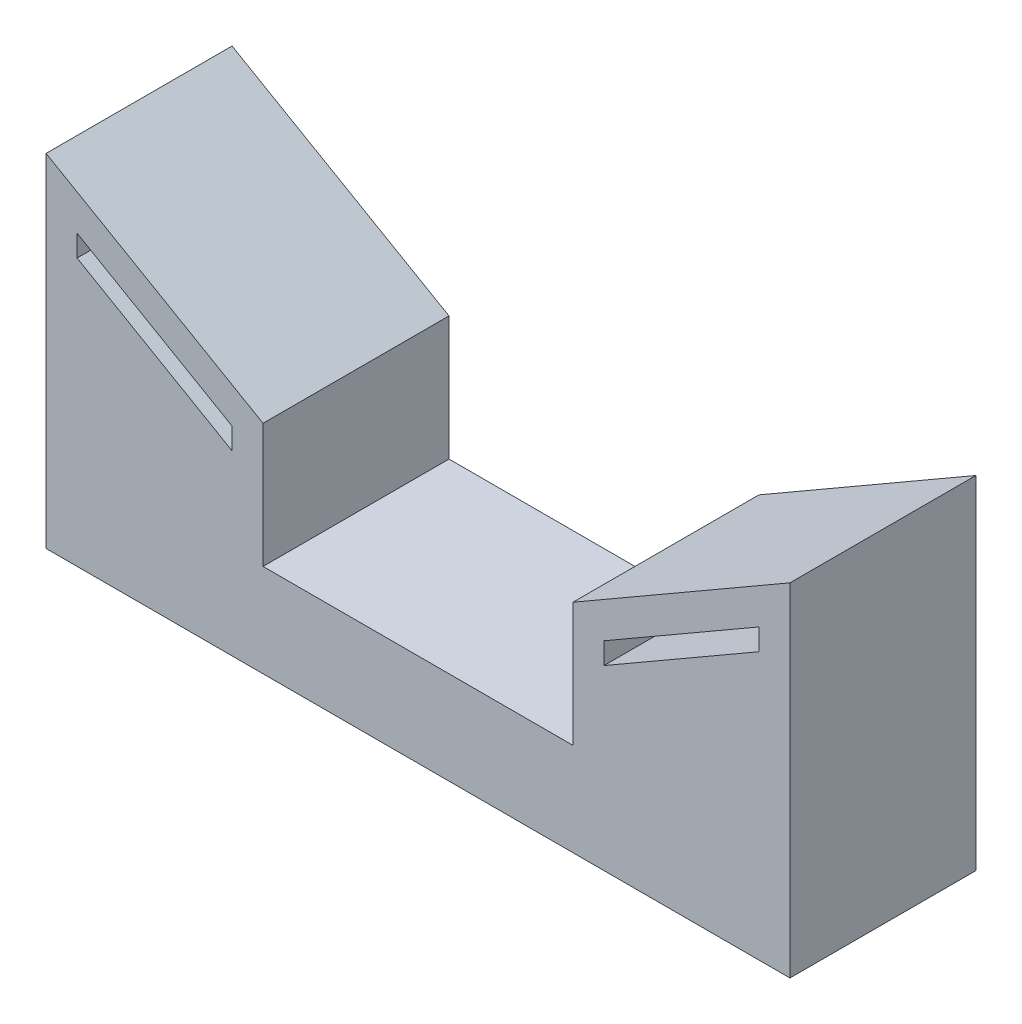
ISO-10303-21;
HEADER;
FILE_DESCRIPTION(('STEP AP214'),'2;1');
FILE_NAME('part.step','',(''),(''),'','','');
FILE_SCHEMA(('AUTOMOTIVE_DESIGN { 1 0 10303 214 1 1 1 1 }'));
ENDSEC;
DATA;
#1=APPLICATION_CONTEXT('core data for automotive mechanical design processes');
#2=APPLICATION_PROTOCOL_DEFINITION('international standard','automotive_design',2000,#1);
#3=PRODUCT_CONTEXT('',#1,'mechanical');
#4=PRODUCT('Part','Part','',(#3));
#5=PRODUCT_RELATED_PRODUCT_CATEGORY('part','',(#4));
#6=PRODUCT_DEFINITION_FORMATION('','',#4);
#7=PRODUCT_DEFINITION_CONTEXT('part definition',#1,'design');
#8=PRODUCT_DEFINITION('design','',#6,#7);
#9=PRODUCT_DEFINITION_SHAPE('','',#8);
#10=(LENGTH_UNIT() NAMED_UNIT(*) SI_UNIT(.MILLI.,.METRE.));
#11=(NAMED_UNIT(*) PLANE_ANGLE_UNIT() SI_UNIT($,.RADIAN.));
#12=(NAMED_UNIT(*) SI_UNIT($,.STERADIAN.) SOLID_ANGLE_UNIT());
#13=UNCERTAINTY_MEASURE_WITH_UNIT(LENGTH_MEASURE(1.E-05),#10,'distance_accuracy_value','');
#14=(GEOMETRIC_REPRESENTATION_CONTEXT(3) GLOBAL_UNCERTAINTY_ASSIGNED_CONTEXT((#13)) GLOBAL_UNIT_ASSIGNED_CONTEXT((#10,
#11,#12)) REPRESENTATION_CONTEXT('',''));
#15=CARTESIAN_POINT('',(0.,0.,0.));
#16=DIRECTION('',(0.,0.,1.));
#17=DIRECTION('',(1.,0.,0.));
#18=AXIS2_PLACEMENT_3D('',#15,#16,#17);
#19=CARTESIAN_POINT('',(0.,0.,30.));
#20=DIRECTION('',(0.,0.,-1.));
#21=DIRECTION('',(-1.,0.,0.));
#22=AXIS2_PLACEMENT_3D('',#19,#20,#21);
#23=PLANE('',#22);
#24=DIRECTION('',(0.,1.,0.));
#25=VECTOR('',#24,1.);
#26=CARTESIAN_POINT('',(55.,31.5470053837924,30.));
#27=LINE('',#26,#25);
#28=CARTESIAN_POINT('',(55.,28.0829037686547,30.));
#29=VERTEX_POINT('',#28);
#30=CARTESIAN_POINT('',(55.,31.5470053837924,30.));
#31=VERTEX_POINT('',#30);
#32=EDGE_CURVE('E184',#29,#31,#27,.T.);
#33=ORIENTED_EDGE('',*,*,#32,.F.);
#34=DIRECTION('',(0.86602540378444,0.499999999999998,0.));
#35=VECTOR('',#34,1.);
#36=CARTESIAN_POINT('',(30.,13.6491470389141,30.));
#37=LINE('',#36,#35);
#38=CARTESIAN_POINT('',(30.,13.6491470389141,30.));
#39=VERTEX_POINT('',#38);
#40=EDGE_CURVE('E192',#39,#29,#37,.T.);
#41=ORIENTED_EDGE('',*,*,#40,.F.);
#42=DIRECTION('',(0.,-1.,0.));
#43=VECTOR('',#42,1.);
#44=CARTESIAN_POINT('',(30.,17.1132486540519,30.));
#45=LINE('',#44,#43);
#46=CARTESIAN_POINT('',(30.,17.1132486540519,30.));
#47=VERTEX_POINT('',#46);
#48=EDGE_CURVE('E189',#47,#39,#45,.T.);
#49=ORIENTED_EDGE('',*,*,#48,.F.);
#50=DIRECTION('',(-0.86602540378444,-0.499999999999998,0.));
#51=VECTOR('',#50,1.);
#52=CARTESIAN_POINT('',(30.,17.1132486540519,30.));
#53=LINE('',#52,#51);
#54=EDGE_CURVE('E186',#31,#47,#53,.T.);
#55=ORIENTED_EDGE('',*,*,#54,.F.);
#56=EDGE_LOOP('',(#33,#41,#49,#55));
#57=FACE_BOUND('',#56,.T.);
#58=DIRECTION('',(0.,-1.,0.));
#59=VECTOR('',#58,1.);
#60=CARTESIAN_POINT('',(-60.,0.,30.));
#61=LINE('',#60,#59);
#62=CARTESIAN_POINT('',(-60.,40.2072594216368,30.));
#63=VERTEX_POINT('',#62);
#64=CARTESIAN_POINT('',(-60.,-15.,30.));
#65=VERTEX_POINT('',#64);
#66=EDGE_CURVE('E215',#63,#65,#61,.T.);
#67=ORIENTED_EDGE('',*,*,#66,.T.);
#68=DIRECTION('',(1.,0.,0.));
#69=VECTOR('',#68,1.);
#70=CARTESIAN_POINT('',(60.,-15.,30.));
#71=LINE('',#70,#69);
#72=CARTESIAN_POINT('',(60.,-15.,30.));
#73=VERTEX_POINT('',#72);
#74=EDGE_CURVE('E218',#65,#73,#71,.T.);
#75=ORIENTED_EDGE('',*,*,#74,.T.);
#76=DIRECTION('',(0.,1.,0.));
#77=VECTOR('',#76,1.);
#78=CARTESIAN_POINT('',(60.,0.,30.));
#79=LINE('',#78,#77);
#80=CARTESIAN_POINT('',(60.,40.2072594216368,30.));
#81=VERTEX_POINT('',#80);
#82=EDGE_CURVE('E221',#73,#81,#79,.T.);
#83=ORIENTED_EDGE('',*,*,#82,.T.);
#84=DIRECTION('',(-0.866025403784439,-0.499999999999998,0.));
#85=VECTOR('',#84,1.);
#86=CARTESIAN_POINT('',(25.,20.,30.));
#87=LINE('',#86,#85);
#88=CARTESIAN_POINT('',(25.,20.,30.));
#89=VERTEX_POINT('',#88);
#90=EDGE_CURVE('E223',#81,#89,#87,.T.);
#91=ORIENTED_EDGE('',*,*,#90,.T.);
#92=DIRECTION('',(0.,-1.,0.));
#93=VECTOR('',#92,1.);
#94=CARTESIAN_POINT('',(25.,20.,30.));
#95=LINE('',#94,#93);
#96=CARTESIAN_POINT('',(25.,0.,30.));
#97=VERTEX_POINT('',#96);
#98=EDGE_CURVE('E225',#89,#97,#95,.T.);
#99=ORIENTED_EDGE('',*,*,#98,.T.);
#100=DIRECTION('',(-1.,0.,0.));
#101=VECTOR('',#100,1.);
#102=CARTESIAN_POINT('',(25.,0.,30.));
#103=LINE('',#102,#101);
#104=CARTESIAN_POINT('',(-25.,0.,30.));
#105=VERTEX_POINT('',#104);
#106=EDGE_CURVE('E227',#97,#105,#103,.T.);
#107=ORIENTED_EDGE('',*,*,#106,.T.);
#108=DIRECTION('',(0.,1.,0.));
#109=VECTOR('',#108,1.);
#110=CARTESIAN_POINT('',(-25.,20.,30.));
#111=LINE('',#110,#109);
#112=CARTESIAN_POINT('',(-25.,20.,30.));
#113=VERTEX_POINT('',#112);
#114=EDGE_CURVE('E229',#105,#113,#111,.T.);
#115=ORIENTED_EDGE('',*,*,#114,.T.);
#116=DIRECTION('',(-0.866025403784439,0.499999999999998,0.));
#117=VECTOR('',#116,1.);
#118=CARTESIAN_POINT('',(-25.,20.,30.));
#119=LINE('',#118,#117);
#120=EDGE_CURVE('E231',#113,#63,#119,.T.);
#121=ORIENTED_EDGE('',*,*,#120,.T.);
#122=EDGE_LOOP('',(#67,#75,#83,#91,#99,#107,#115,#121));
#123=FACE_BOUND('',#122,.T.);
#124=DIRECTION('',(-0.86602540378444,0.499999999999998,0.));
#125=VECTOR('',#124,1.);
#126=CARTESIAN_POINT('',(-30.,17.1132486540519,30.));
#127=LINE('',#126,#125);
#128=CARTESIAN_POINT('',(-30.,17.1132486540519,30.));
#129=VERTEX_POINT('',#128);
#130=CARTESIAN_POINT('',(-55.,31.5470053837924,30.));
#131=VERTEX_POINT('',#130);
#132=EDGE_CURVE('E148',#129,#131,#127,.T.);
#133=ORIENTED_EDGE('',*,*,#132,.F.);
#134=DIRECTION('',(0.,1.,0.));
#135=VECTOR('',#134,1.);
#136=CARTESIAN_POINT('',(-30.,17.1132486540519,30.));
#137=LINE('',#136,#135);
#138=CARTESIAN_POINT('',(-30.,13.6491470389141,30.));
#139=VERTEX_POINT('',#138);
#140=EDGE_CURVE('E170',#139,#129,#137,.T.);
#141=ORIENTED_EDGE('',*,*,#140,.F.);
#142=DIRECTION('',(0.86602540378444,-0.499999999999998,0.));
#143=VECTOR('',#142,1.);
#144=CARTESIAN_POINT('',(-30.,13.6491470389141,30.));
#145=LINE('',#144,#143);
#146=CARTESIAN_POINT('',(-55.,28.0829037686547,30.));
#147=VERTEX_POINT('',#146);
#148=EDGE_CURVE('E168',#147,#139,#145,.T.);
#149=ORIENTED_EDGE('',*,*,#148,.F.);
#150=DIRECTION('',(0.,-1.,0.));
#151=VECTOR('',#150,1.);
#152=CARTESIAN_POINT('',(-55.,31.5470053837924,30.));
#153=LINE('',#152,#151);
#154=EDGE_CURVE('E156',#131,#147,#153,.T.);
#155=ORIENTED_EDGE('',*,*,#154,.F.);
#156=EDGE_LOOP('',(#133,#141,#149,#155));
#157=FACE_BOUND('',#156,.T.);
#158=ADVANCED_FACE('F35',(#57,#123,#157),#23,.F.);
#159=CARTESIAN_POINT('',(0.,0.,0.));
#160=DIRECTION('',(0.,0.,-1.));
#161=DIRECTION('',(-1.,0.,0.));
#162=AXIS2_PLACEMENT_3D('',#159,#160,#161);
#163=PLANE('',#162);
#164=DIRECTION('',(1.,0.,0.));
#165=VECTOR('',#164,1.);
#166=CARTESIAN_POINT('',(60.,-15.,0.));
#167=LINE('',#166,#165);
#168=CARTESIAN_POINT('',(-60.,-15.,0.));
#169=VERTEX_POINT('',#168);
#170=CARTESIAN_POINT('',(60.,-15.,0.));
#171=VERTEX_POINT('',#170);
#172=EDGE_CURVE('E214',#169,#171,#167,.T.);
#173=ORIENTED_EDGE('',*,*,#172,.F.);
#174=DIRECTION('',(0.,-1.,0.));
#175=VECTOR('',#174,1.);
#176=CARTESIAN_POINT('',(-60.,0.,0.));
#177=LINE('',#176,#175);
#178=CARTESIAN_POINT('',(-60.,40.2072594216368,0.));
#179=VERTEX_POINT('',#178);
#180=EDGE_CURVE('E219',#179,#169,#177,.T.);
#181=ORIENTED_EDGE('',*,*,#180,.F.);
#182=DIRECTION('',(-0.866025403784439,0.499999999999998,0.));
#183=VECTOR('',#182,1.);
#184=CARTESIAN_POINT('',(-25.,20.,0.));
#185=LINE('',#184,#183);
#186=CARTESIAN_POINT('',(-25.,20.,0.));
#187=VERTEX_POINT('',#186);
#188=EDGE_CURVE('E247',#187,#179,#185,.T.);
#189=ORIENTED_EDGE('',*,*,#188,.F.);
#190=DIRECTION('',(0.,1.,0.));
#191=VECTOR('',#190,1.);
#192=CARTESIAN_POINT('',(-25.,20.,0.));
#193=LINE('',#192,#191);
#194=CARTESIAN_POINT('',(-25.,0.,0.));
#195=VERTEX_POINT('',#194);
#196=EDGE_CURVE('E245',#195,#187,#193,.T.);
#197=ORIENTED_EDGE('',*,*,#196,.F.);
#198=DIRECTION('',(-1.,0.,0.));
#199=VECTOR('',#198,1.);
#200=CARTESIAN_POINT('',(25.,0.,0.));
#201=LINE('',#200,#199);
#202=CARTESIAN_POINT('',(25.,0.,0.));
#203=VERTEX_POINT('',#202);
#204=EDGE_CURVE('E243',#203,#195,#201,.T.);
#205=ORIENTED_EDGE('',*,*,#204,.F.);
#206=DIRECTION('',(0.,-1.,0.));
#207=VECTOR('',#206,1.);
#208=CARTESIAN_POINT('',(25.,20.,0.));
#209=LINE('',#208,#207);
#210=CARTESIAN_POINT('',(25.,20.,0.));
#211=VERTEX_POINT('',#210);
#212=EDGE_CURVE('E241',#211,#203,#209,.T.);
#213=ORIENTED_EDGE('',*,*,#212,.F.);
#214=DIRECTION('',(-0.866025403784439,-0.499999999999998,0.));
#215=VECTOR('',#214,1.);
#216=CARTESIAN_POINT('',(25.,20.,0.));
#217=LINE('',#216,#215);
#218=CARTESIAN_POINT('',(60.,40.2072594216368,0.));
#219=VERTEX_POINT('',#218);
#220=EDGE_CURVE('E239',#219,#211,#217,.T.);
#221=ORIENTED_EDGE('',*,*,#220,.F.);
#222=DIRECTION('',(0.,1.,0.));
#223=VECTOR('',#222,1.);
#224=CARTESIAN_POINT('',(60.,0.,0.));
#225=LINE('',#224,#223);
#226=EDGE_CURVE('E237',#171,#219,#225,.T.);
#227=ORIENTED_EDGE('',*,*,#226,.F.);
#228=EDGE_LOOP('',(#173,#181,#189,#197,#205,#213,#221,#227));
#229=FACE_BOUND('',#228,.T.);
#230=DIRECTION('',(0.86602540378444,0.499999999999998,0.));
#231=VECTOR('',#230,1.);
#232=CARTESIAN_POINT('',(30.,13.6491470389141,0.));
#233=LINE('',#232,#231);
#234=CARTESIAN_POINT('',(30.,13.6491470389141,0.));
#235=VERTEX_POINT('',#234);
#236=CARTESIAN_POINT('',(55.,28.0829037686547,0.));
#237=VERTEX_POINT('',#236);
#238=EDGE_CURVE('E187',#235,#237,#233,.T.);
#239=ORIENTED_EDGE('',*,*,#238,.T.);
#240=DIRECTION('',(0.,1.,0.));
#241=VECTOR('',#240,1.);
#242=CARTESIAN_POINT('',(55.,31.5470053837924,0.));
#243=LINE('',#242,#241);
#244=CARTESIAN_POINT('',(55.,31.5470053837924,0.));
#245=VERTEX_POINT('',#244);
#246=EDGE_CURVE('E164',#237,#245,#243,.T.);
#247=ORIENTED_EDGE('',*,*,#246,.T.);
#248=DIRECTION('',(-0.86602540378444,-0.499999999999998,0.));
#249=VECTOR('',#248,1.);
#250=CARTESIAN_POINT('',(30.,17.1132486540519,0.));
#251=LINE('',#250,#249);
#252=CARTESIAN_POINT('',(30.,17.1132486540519,0.));
#253=VERTEX_POINT('',#252);
#254=EDGE_CURVE('E197',#245,#253,#251,.T.);
#255=ORIENTED_EDGE('',*,*,#254,.T.);
#256=DIRECTION('',(0.,-1.,0.));
#257=VECTOR('',#256,1.);
#258=CARTESIAN_POINT('',(30.,17.1132486540519,0.));
#259=LINE('',#258,#257);
#260=EDGE_CURVE('E200',#253,#235,#259,.T.);
#261=ORIENTED_EDGE('',*,*,#260,.T.);
#262=EDGE_LOOP('',(#239,#247,#255,#261));
#263=FACE_BOUND('',#262,.T.);
#264=DIRECTION('',(0.,1.,0.));
#265=VECTOR('',#264,1.);
#266=CARTESIAN_POINT('',(-30.,17.1132486540519,0.));
#267=LINE('',#266,#265);
#268=CARTESIAN_POINT('',(-30.,13.6491470389141,0.));
#269=VERTEX_POINT('',#268);
#270=CARTESIAN_POINT('',(-30.,17.1132486540519,0.));
#271=VERTEX_POINT('',#270);
#272=EDGE_CURVE('E157',#269,#271,#267,.T.);
#273=ORIENTED_EDGE('',*,*,#272,.T.);
#274=DIRECTION('',(-0.86602540378444,0.499999999999998,0.));
#275=VECTOR('',#274,1.);
#276=CARTESIAN_POINT('',(-30.,17.1132486540519,0.));
#277=LINE('',#276,#275);
#278=CARTESIAN_POINT('',(-55.,31.5470053837924,0.));
#279=VERTEX_POINT('',#278);
#280=EDGE_CURVE('E58',#271,#279,#277,.T.);
#281=ORIENTED_EDGE('',*,*,#280,.T.);
#282=DIRECTION('',(0.,-1.,0.));
#283=VECTOR('',#282,1.);
#284=CARTESIAN_POINT('',(-55.,31.5470053837924,0.));
#285=LINE('',#284,#283);
#286=CARTESIAN_POINT('',(-55.,28.0829037686547,0.));
#287=VERTEX_POINT('',#286);
#288=EDGE_CURVE('E163',#279,#287,#285,.T.);
#289=ORIENTED_EDGE('',*,*,#288,.T.);
#290=DIRECTION('',(0.86602540378444,-0.499999999999998,0.));
#291=VECTOR('',#290,1.);
#292=CARTESIAN_POINT('',(-30.,13.6491470389141,0.));
#293=LINE('',#292,#291);
#294=EDGE_CURVE('E176',#287,#269,#293,.T.);
#295=ORIENTED_EDGE('',*,*,#294,.T.);
#296=EDGE_LOOP('',(#273,#281,#289,#295));
#297=FACE_BOUND('',#296,.T.);
#298=ADVANCED_FACE('F277',(#229,#263,#297),#163,.T.);
#299=CARTESIAN_POINT('',(60.,-15.,30.));
#300=DIRECTION('',(0.,1.,0.));
#301=DIRECTION('',(0.,0.,1.));
#302=AXIS2_PLACEMENT_3D('',#299,#300,#301);
#303=PLANE('',#302);
#304=ORIENTED_EDGE('',*,*,#172,.T.);
#305=DIRECTION('',(0.,0.,-1.));
#306=VECTOR('',#305,1.);
#307=CARTESIAN_POINT('',(60.,-15.,30.));
#308=LINE('',#307,#306);
#309=EDGE_CURVE('E43',#73,#171,#308,.T.);
#310=ORIENTED_EDGE('',*,*,#309,.F.);
#311=ORIENTED_EDGE('',*,*,#74,.F.);
#312=DIRECTION('',(0.,0.,-1.));
#313=VECTOR('',#312,1.);
#314=CARTESIAN_POINT('',(-60.,-15.,30.));
#315=LINE('',#314,#313);
#316=EDGE_CURVE('E11',#65,#169,#315,.T.);
#317=ORIENTED_EDGE('',*,*,#316,.T.);
#318=EDGE_LOOP('',(#304,#310,#311,#317));
#319=FACE_BOUND('',#318,.T.);
#320=ADVANCED_FACE('F37',(#319),#303,.F.);
#321=CARTESIAN_POINT('',(60.,0.,30.));
#322=DIRECTION('',(-1.,0.,0.));
#323=DIRECTION('',(0.,-1.,0.));
#324=AXIS2_PLACEMENT_3D('',#321,#322,#323);
#325=PLANE('',#324);
#326=ORIENTED_EDGE('',*,*,#226,.T.);
#327=DIRECTION('',(0.,0.,-1.));
#328=VECTOR('',#327,1.);
#329=CARTESIAN_POINT('',(60.,40.2072594216368,30.));
#330=LINE('',#329,#328);
#331=EDGE_CURVE('E264',#81,#219,#330,.T.);
#332=ORIENTED_EDGE('',*,*,#331,.F.);
#333=ORIENTED_EDGE('',*,*,#82,.F.);
#334=ORIENTED_EDGE('',*,*,#309,.T.);
#335=EDGE_LOOP('',(#326,#332,#333,#334));
#336=FACE_BOUND('',#335,.T.);
#337=ADVANCED_FACE('F270',(#336),#325,.F.);
#338=CARTESIAN_POINT('',(25.,20.,30.));
#339=DIRECTION('',(0.499999999999998,-0.866025403784439,0.));
#340=DIRECTION('',(0.86602540378444,0.499999999999999,0.));
#341=AXIS2_PLACEMENT_3D('',#338,#339,#340);
#342=PLANE('',#341);
#343=ORIENTED_EDGE('',*,*,#220,.T.);
#344=DIRECTION('',(0.,0.,-1.));
#345=VECTOR('',#344,1.);
#346=CARTESIAN_POINT('',(25.,20.,30.));
#347=LINE('',#346,#345);
#348=EDGE_CURVE('E261',#89,#211,#347,.T.);
#349=ORIENTED_EDGE('',*,*,#348,.F.);
#350=ORIENTED_EDGE('',*,*,#90,.F.);
#351=ORIENTED_EDGE('',*,*,#331,.T.);
#352=EDGE_LOOP('',(#343,#349,#350,#351));
#353=FACE_BOUND('',#352,.T.);
#354=ADVANCED_FACE('F285',(#353),#342,.F.);
#355=CARTESIAN_POINT('',(25.,20.,30.));
#356=DIRECTION('',(1.,0.,0.));
#357=DIRECTION('',(0.,1.,0.));
#358=AXIS2_PLACEMENT_3D('',#355,#356,#357);
#359=PLANE('',#358);
#360=ORIENTED_EDGE('',*,*,#212,.T.);
#361=DIRECTION('',(0.,0.,-1.));
#362=VECTOR('',#361,1.);
#363=CARTESIAN_POINT('',(25.,0.,30.));
#364=LINE('',#363,#362);
#365=EDGE_CURVE('E258',#97,#203,#364,.T.);
#366=ORIENTED_EDGE('',*,*,#365,.F.);
#367=ORIENTED_EDGE('',*,*,#98,.F.);
#368=ORIENTED_EDGE('',*,*,#348,.T.);
#369=EDGE_LOOP('',(#360,#366,#367,#368));
#370=FACE_BOUND('',#369,.T.);
#371=ADVANCED_FACE('F289',(#370),#359,.F.);
#372=CARTESIAN_POINT('',(25.,0.,30.));
#373=DIRECTION('',(0.,-1.,0.));
#374=DIRECTION('',(0.,0.,-1.));
#375=AXIS2_PLACEMENT_3D('',#372,#373,#374);
#376=PLANE('',#375);
#377=ORIENTED_EDGE('',*,*,#204,.T.);
#378=DIRECTION('',(0.,0.,-1.));
#379=VECTOR('',#378,1.);
#380=CARTESIAN_POINT('',(-25.,0.,30.));
#381=LINE('',#380,#379);
#382=EDGE_CURVE('E255',#105,#195,#381,.T.);
#383=ORIENTED_EDGE('',*,*,#382,.F.);
#384=ORIENTED_EDGE('',*,*,#106,.F.);
#385=ORIENTED_EDGE('',*,*,#365,.T.);
#386=EDGE_LOOP('',(#377,#383,#384,#385));
#387=FACE_BOUND('',#386,.T.);
#388=ADVANCED_FACE('F306',(#387),#376,.F.);
#389=CARTESIAN_POINT('',(-25.,20.,30.));
#390=DIRECTION('',(-1.,0.,0.));
#391=DIRECTION('',(0.,-1.,0.));
#392=AXIS2_PLACEMENT_3D('',#389,#390,#391);
#393=PLANE('',#392);
#394=ORIENTED_EDGE('',*,*,#196,.T.);
#395=DIRECTION('',(0.,0.,-1.));
#396=VECTOR('',#395,1.);
#397=CARTESIAN_POINT('',(-25.,20.,30.));
#398=LINE('',#397,#396);
#399=EDGE_CURVE('E252',#113,#187,#398,.T.);
#400=ORIENTED_EDGE('',*,*,#399,.F.);
#401=ORIENTED_EDGE('',*,*,#114,.F.);
#402=ORIENTED_EDGE('',*,*,#382,.T.);
#403=EDGE_LOOP('',(#394,#400,#401,#402));
#404=FACE_BOUND('',#403,.T.);
#405=ADVANCED_FACE('F303',(#404),#393,.F.);
#406=CARTESIAN_POINT('',(-25.,20.,30.));
#407=DIRECTION('',(-0.499999999999998,-0.866025403784439,0.));
#408=DIRECTION('',(0.86602540378444,-0.499999999999999,0.));
#409=AXIS2_PLACEMENT_3D('',#406,#407,#408);
#410=PLANE('',#409);
#411=ORIENTED_EDGE('',*,*,#188,.T.);
#412=DIRECTION('',(0.,0.,-1.));
#413=VECTOR('',#412,1.);
#414=CARTESIAN_POINT('',(-60.,40.2072594216368,30.));
#415=LINE('',#414,#413);
#416=EDGE_CURVE('E234',#63,#179,#415,.T.);
#417=ORIENTED_EDGE('',*,*,#416,.F.);
#418=ORIENTED_EDGE('',*,*,#120,.F.);
#419=ORIENTED_EDGE('',*,*,#399,.T.);
#420=EDGE_LOOP('',(#411,#417,#418,#419));
#421=FACE_BOUND('',#420,.T.);
#422=ADVANCED_FACE('F299',(#421),#410,.F.);
#423=CARTESIAN_POINT('',(-60.,0.,30.));
#424=DIRECTION('',(1.,0.,0.));
#425=DIRECTION('',(0.,1.,0.));
#426=AXIS2_PLACEMENT_3D('',#423,#424,#425);
#427=PLANE('',#426);
#428=ORIENTED_EDGE('',*,*,#180,.T.);
#429=ORIENTED_EDGE('',*,*,#316,.F.);
#430=ORIENTED_EDGE('',*,*,#66,.F.);
#431=ORIENTED_EDGE('',*,*,#416,.T.);
#432=EDGE_LOOP('',(#428,#429,#430,#431));
#433=FACE_BOUND('',#432,.T.);
#434=ADVANCED_FACE('F297',(#433),#427,.F.);
#435=CARTESIAN_POINT('',(55.,31.5470053837924,30.));
#436=DIRECTION('',(-1.,0.,0.));
#437=DIRECTION('',(0.,-1.,0.));
#438=AXIS2_PLACEMENT_3D('',#435,#436,#437);
#439=PLANE('',#438);
#440=ORIENTED_EDGE('',*,*,#246,.F.);
#441=DIRECTION('',(0.,0.,-1.));
#442=VECTOR('',#441,1.);
#443=CARTESIAN_POINT('',(55.,28.0829037686547,30.));
#444=LINE('',#443,#442);
#445=EDGE_CURVE('E194',#29,#237,#444,.T.);
#446=ORIENTED_EDGE('',*,*,#445,.F.);
#447=ORIENTED_EDGE('',*,*,#32,.T.);
#448=DIRECTION('',(0.,0.,-1.));
#449=VECTOR('',#448,1.);
#450=CARTESIAN_POINT('',(55.,31.5470053837924,30.));
#451=LINE('',#450,#449);
#452=EDGE_CURVE('E211',#31,#245,#451,.T.);
#453=ORIENTED_EDGE('',*,*,#452,.T.);
#454=EDGE_LOOP('',(#440,#446,#447,#453));
#455=FACE_BOUND('',#454,.T.);
#456=ADVANCED_FACE('F324',(#455),#439,.T.);
#457=CARTESIAN_POINT('',(30.,17.1132486540519,30.));
#458=DIRECTION('',(0.499999999999998,-0.86602540378444,0.));
#459=DIRECTION('',(0.86602540378444,0.499999999999998,0.));
#460=AXIS2_PLACEMENT_3D('',#457,#458,#459);
#461=PLANE('',#460);
#462=ORIENTED_EDGE('',*,*,#254,.F.);
#463=ORIENTED_EDGE('',*,*,#452,.F.);
#464=ORIENTED_EDGE('',*,*,#54,.T.);
#465=DIRECTION('',(0.,0.,-1.));
#466=VECTOR('',#465,1.);
#467=CARTESIAN_POINT('',(30.,17.1132486540519,30.));
#468=LINE('',#467,#466);
#469=EDGE_CURVE('E209',#47,#253,#468,.T.);
#470=ORIENTED_EDGE('',*,*,#469,.T.);
#471=EDGE_LOOP('',(#462,#463,#464,#470));
#472=FACE_BOUND('',#471,.T.);
#473=ADVANCED_FACE('F344',(#472),#461,.T.);
#474=CARTESIAN_POINT('',(30.,17.1132486540519,30.));
#475=DIRECTION('',(1.,0.,0.));
#476=DIRECTION('',(0.,0.,-1.));
#477=AXIS2_PLACEMENT_3D('',#474,#475,#476);
#478=PLANE('',#477);
#479=ORIENTED_EDGE('',*,*,#260,.F.);
#480=ORIENTED_EDGE('',*,*,#469,.F.);
#481=ORIENTED_EDGE('',*,*,#48,.T.);
#482=DIRECTION('',(0.,0.,-1.));
#483=VECTOR('',#482,1.);
#484=CARTESIAN_POINT('',(30.,13.6491470389141,30.));
#485=LINE('',#484,#483);
#486=EDGE_CURVE('E207',#39,#235,#485,.T.);
#487=ORIENTED_EDGE('',*,*,#486,.T.);
#488=EDGE_LOOP('',(#479,#480,#481,#487));
#489=FACE_BOUND('',#488,.T.);
#490=ADVANCED_FACE('F351',(#489),#478,.T.);
#491=CARTESIAN_POINT('',(30.,13.6491470389141,30.));
#492=DIRECTION('',(-0.499999999999998,0.86602540378444,0.));
#493=DIRECTION('',(-0.86602540378444,-0.499999999999998,0.));
#494=AXIS2_PLACEMENT_3D('',#491,#492,#493);
#495=PLANE('',#494);
#496=ORIENTED_EDGE('',*,*,#238,.F.);
#497=ORIENTED_EDGE('',*,*,#486,.F.);
#498=ORIENTED_EDGE('',*,*,#40,.T.);
#499=ORIENTED_EDGE('',*,*,#445,.T.);
#500=EDGE_LOOP('',(#496,#497,#498,#499));
#501=FACE_BOUND('',#500,.T.);
#502=ADVANCED_FACE('F358',(#501),#495,.T.);
#503=CARTESIAN_POINT('',(-30.,17.1132486540519,30.));
#504=DIRECTION('',(-0.499999999999998,-0.86602540378444,0.));
#505=DIRECTION('',(0.86602540378444,-0.499999999999998,0.));
#506=AXIS2_PLACEMENT_3D('',#503,#504,#505);
#507=PLANE('',#506);
#508=ORIENTED_EDGE('',*,*,#280,.F.);
#509=DIRECTION('',(0.,0.,-1.));
#510=VECTOR('',#509,1.);
#511=CARTESIAN_POINT('',(-30.,17.1132486540519,30.));
#512=LINE('',#511,#510);
#513=EDGE_CURVE('E152',#129,#271,#512,.T.);
#514=ORIENTED_EDGE('',*,*,#513,.F.);
#515=ORIENTED_EDGE('',*,*,#132,.T.);
#516=DIRECTION('',(0.,0.,-1.));
#517=VECTOR('',#516,1.);
#518=CARTESIAN_POINT('',(-55.,31.5470053837924,30.));
#519=LINE('',#518,#517);
#520=EDGE_CURVE('E151',#131,#279,#519,.T.);
#521=ORIENTED_EDGE('',*,*,#520,.T.);
#522=EDGE_LOOP('',(#508,#514,#515,#521));
#523=FACE_BOUND('',#522,.T.);
#524=ADVANCED_FACE('F150',(#523),#507,.T.);
#525=CARTESIAN_POINT('',(-55.,31.5470053837924,30.));
#526=DIRECTION('',(1.,0.,0.));
#527=DIRECTION('',(0.,1.,0.));
#528=AXIS2_PLACEMENT_3D('',#525,#526,#527);
#529=PLANE('',#528);
#530=ORIENTED_EDGE('',*,*,#288,.F.);
#531=ORIENTED_EDGE('',*,*,#520,.F.);
#532=ORIENTED_EDGE('',*,*,#154,.T.);
#533=DIRECTION('',(0.,0.,-1.));
#534=VECTOR('',#533,1.);
#535=CARTESIAN_POINT('',(-55.,28.0829037686547,30.));
#536=LINE('',#535,#534);
#537=EDGE_CURVE('E165',#147,#287,#536,.T.);
#538=ORIENTED_EDGE('',*,*,#537,.T.);
#539=EDGE_LOOP('',(#530,#531,#532,#538));
#540=FACE_BOUND('',#539,.T.);
#541=ADVANCED_FACE('F160',(#540),#529,.T.);
#542=CARTESIAN_POINT('',(-30.,13.6491470389141,30.));
#543=DIRECTION('',(0.499999999999998,0.86602540378444,0.));
#544=DIRECTION('',(-0.86602540378444,0.499999999999998,0.));
#545=AXIS2_PLACEMENT_3D('',#542,#543,#544);
#546=PLANE('',#545);
#547=ORIENTED_EDGE('',*,*,#294,.F.);
#548=ORIENTED_EDGE('',*,*,#537,.F.);
#549=ORIENTED_EDGE('',*,*,#148,.T.);
#550=DIRECTION('',(0.,0.,-1.));
#551=VECTOR('',#550,1.);
#552=CARTESIAN_POINT('',(-30.,13.6491470389141,30.));
#553=LINE('',#552,#551);
#554=EDGE_CURVE('E50',#139,#269,#553,.T.);
#555=ORIENTED_EDGE('',*,*,#554,.T.);
#556=EDGE_LOOP('',(#547,#548,#549,#555));
#557=FACE_BOUND('',#556,.T.);
#558=ADVANCED_FACE('F379',(#557),#546,.T.);
#559=CARTESIAN_POINT('',(-30.,17.1132486540519,30.));
#560=DIRECTION('',(-1.,0.,0.));
#561=DIRECTION('',(0.,0.,1.));
#562=AXIS2_PLACEMENT_3D('',#559,#560,#561);
#563=PLANE('',#562);
#564=ORIENTED_EDGE('',*,*,#272,.F.);
#565=ORIENTED_EDGE('',*,*,#554,.F.);
#566=ORIENTED_EDGE('',*,*,#140,.T.);
#567=ORIENTED_EDGE('',*,*,#513,.T.);
#568=EDGE_LOOP('',(#564,#565,#566,#567));
#569=FACE_BOUND('',#568,.T.);
#570=ADVANCED_FACE('F386',(#569),#563,.T.);
#571=CLOSED_SHELL('',(#158,#298,#320,#337,#354,#371,#388,#405,#422,#434,#456,#473,#490,#502,
#524,#541,#558,#570));
#572=MANIFOLD_SOLID_BREP('B2',#571);
#573=ADVANCED_BREP_SHAPE_REPRESENTATION('',(#18,#572),#14);
#574=SHAPE_DEFINITION_REPRESENTATION(#9,#573);
ENDSEC;
END-ISO-10303-21;
